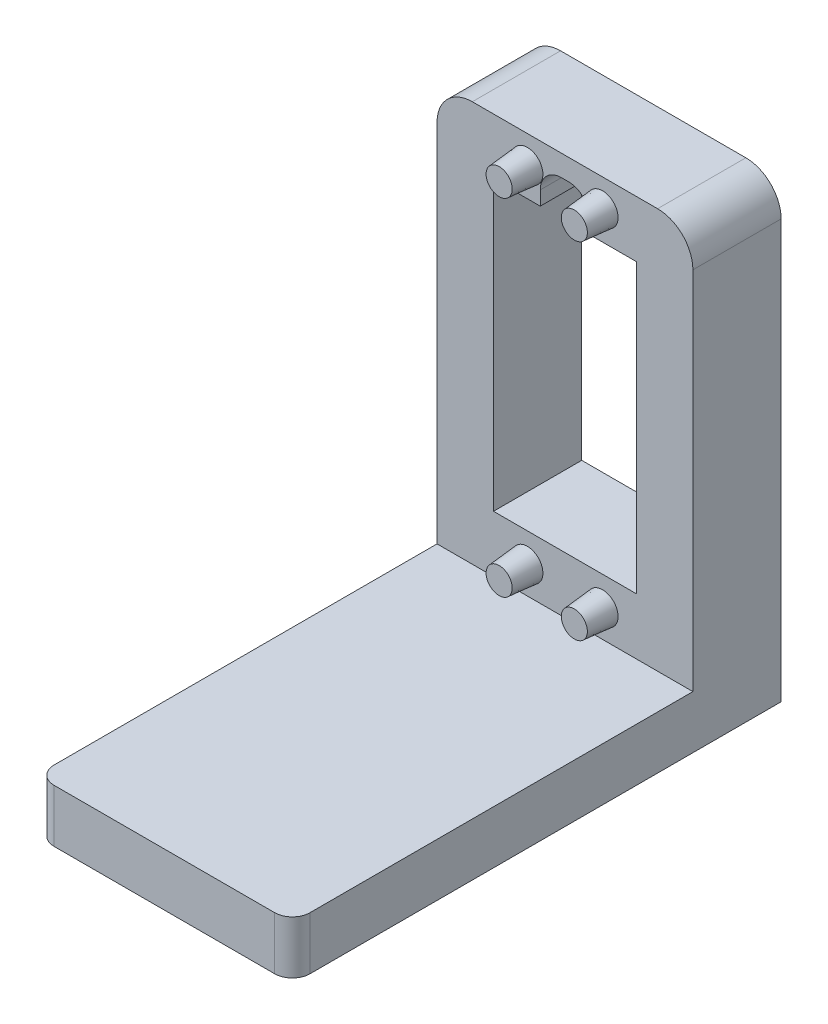
ISO-10303-21;
HEADER;
FILE_DESCRIPTION(('STEP AP214'),'2;1');
FILE_NAME('part.step','',(''),(''),'','','');
FILE_SCHEMA(('AUTOMOTIVE_DESIGN { 1 0 10303 214 1 1 1 1 }'));
ENDSEC;
DATA;
#1=APPLICATION_CONTEXT('core data for automotive mechanical design processes');
#2=APPLICATION_PROTOCOL_DEFINITION('international standard','automotive_design',2000,#1);
#3=PRODUCT_CONTEXT('',#1,'mechanical');
#4=PRODUCT('Part','Part','',(#3));
#5=PRODUCT_RELATED_PRODUCT_CATEGORY('part','',(#4));
#6=PRODUCT_DEFINITION_FORMATION('','',#4);
#7=PRODUCT_DEFINITION_CONTEXT('part definition',#1,'design');
#8=PRODUCT_DEFINITION('design','',#6,#7);
#9=PRODUCT_DEFINITION_SHAPE('','',#8);
#10=(LENGTH_UNIT() NAMED_UNIT(*) SI_UNIT(.MILLI.,.METRE.));
#11=(NAMED_UNIT(*) PLANE_ANGLE_UNIT() SI_UNIT($,.RADIAN.));
#12=(NAMED_UNIT(*) SI_UNIT($,.STERADIAN.) SOLID_ANGLE_UNIT());
#13=UNCERTAINTY_MEASURE_WITH_UNIT(LENGTH_MEASURE(1.E-05),#10,'distance_accuracy_value','');
#14=(GEOMETRIC_REPRESENTATION_CONTEXT(3) GLOBAL_UNCERTAINTY_ASSIGNED_CONTEXT((#13)) GLOBAL_UNIT_ASSIGNED_CONTEXT((#10,
#11,#12)) REPRESENTATION_CONTEXT('',''));
#15=CARTESIAN_POINT('',(0.,0.,0.));
#16=DIRECTION('',(0.,0.,1.));
#17=DIRECTION('',(1.,0.,0.));
#18=AXIS2_PLACEMENT_3D('',#15,#16,#17);
#19=CARTESIAN_POINT('',(0.,40.75,12.5));
#20=DIRECTION('',(0.,-1.,0.));
#21=DIRECTION('',(0.,0.,-1.));
#22=AXIS2_PLACEMENT_3D('',#19,#20,#21);
#23=PLANE('',#22);
#24=DIRECTION('',(0.,0.,1.));
#25=VECTOR('',#24,1.);
#26=CARTESIAN_POINT('',(6.625,40.75,0.));
#27=LINE('',#26,#25);
#28=CARTESIAN_POINT('',(6.625,40.75,0.));
#29=VERTEX_POINT('',#28);
#30=CARTESIAN_POINT('',(6.625,40.75,12.5));
#31=VERTEX_POINT('',#30);
#32=EDGE_CURVE('E177',#29,#31,#27,.T.);
#33=ORIENTED_EDGE('',*,*,#32,.T.);
#34=DIRECTION('',(-1.,0.,0.));
#35=VECTOR('',#34,1.);
#36=CARTESIAN_POINT('',(0.,40.75,12.5));
#37=LINE('',#36,#35);
#38=CARTESIAN_POINT('',(0.,40.75,12.5));
#39=VERTEX_POINT('',#38);
#40=EDGE_CURVE('E365',#31,#39,#37,.T.);
#41=ORIENTED_EDGE('',*,*,#40,.T.);
#42=DIRECTION('',(0.,0.,-1.));
#43=VECTOR('',#42,1.);
#44=CARTESIAN_POINT('',(0.,40.75,12.5));
#45=LINE('',#44,#43);
#46=CARTESIAN_POINT('',(0.,40.75,0.));
#47=VERTEX_POINT('',#46);
#48=EDGE_CURVE('E205',#39,#47,#45,.T.);
#49=ORIENTED_EDGE('',*,*,#48,.T.);
#50=DIRECTION('',(-1.,0.,0.));
#51=VECTOR('',#50,1.);
#52=CARTESIAN_POINT('',(0.,40.75,0.));
#53=LINE('',#52,#51);
#54=EDGE_CURVE('E195',#29,#47,#53,.T.);
#55=ORIENTED_EDGE('',*,*,#54,.F.);
#56=EDGE_LOOP('',(#33,#41,#49,#55));
#57=FACE_BOUND('',#56,.T.);
#58=ADVANCED_FACE('F38',(#57),#23,.T.);
#59=CARTESIAN_POINT('',(0.,0.,12.5));
#60=DIRECTION('',(0.,0.,-1.));
#61=DIRECTION('',(-1.,0.,0.));
#62=AXIS2_PLACEMENT_3D('',#59,#60,#61);
#63=PLANE('',#62);
#64=CARTESIAN_POINT('',(4.8,-4.10000000000001,12.5));
#65=DIRECTION('',(0.,0.,-1.));
#66=DIRECTION('',(-1.,0.,0.));
#67=AXIS2_PLACEMENT_3D('',#64,#65,#66);
#68=CIRCLE('',#67,2.2);
#69=CARTESIAN_POINT('',(2.6,-4.10000000000001,12.5));
#70=VERTEX_POINT('',#69);
#71=EDGE_CURVE('E270',#70,#70,#68,.F.);
#72=ORIENTED_EDGE('',*,*,#71,.F.);
#73=EDGE_LOOP('',(#72));
#74=FACE_BOUND('',#73,.T.);
#75=CARTESIAN_POINT('',(15.45,-4.10000000000001,12.5));
#76=DIRECTION('',(0.,0.,-1.));
#77=DIRECTION('',(-1.,0.,0.));
#78=AXIS2_PLACEMENT_3D('',#75,#76,#77);
#79=CIRCLE('',#78,2.2);
#80=CARTESIAN_POINT('',(13.25,-4.10000000000001,12.5));
#81=VERTEX_POINT('',#80);
#82=EDGE_CURVE('E266',#81,#81,#79,.F.);
#83=ORIENTED_EDGE('',*,*,#82,.F.);
#84=EDGE_LOOP('',(#83));
#85=FACE_BOUND('',#84,.T.);
#86=CARTESIAN_POINT('',(15.45,44.85,12.5));
#87=DIRECTION('',(0.,0.,-1.));
#88=DIRECTION('',(-1.,0.,0.));
#89=AXIS2_PLACEMENT_3D('',#86,#87,#88);
#90=CIRCLE('',#89,2.2);
#91=CARTESIAN_POINT('',(13.25,44.85,12.5));
#92=VERTEX_POINT('',#91);
#93=EDGE_CURVE('E262',#92,#92,#90,.F.);
#94=ORIENTED_EDGE('',*,*,#93,.F.);
#95=EDGE_LOOP('',(#94));
#96=FACE_BOUND('',#95,.T.);
#97=CARTESIAN_POINT('',(4.8,44.85,12.5));
#98=DIRECTION('',(0.,0.,-1.));
#99=DIRECTION('',(-1.,0.,0.));
#100=AXIS2_PLACEMENT_3D('',#97,#98,#99);
#101=CIRCLE('',#100,2.2);
#102=CARTESIAN_POINT('',(2.6,44.85,12.5));
#103=VERTEX_POINT('',#102);
#104=EDGE_CURVE('E249',#103,#103,#101,.F.);
#105=ORIENTED_EDGE('',*,*,#104,.F.);
#106=EDGE_LOOP('',(#105));
#107=FACE_BOUND('',#106,.T.);
#108=DIRECTION('',(0.,1.,0.));
#109=VECTOR('',#108,1.);
#110=CARTESIAN_POINT('',(28.25,-8.,12.5));
#111=LINE('',#110,#109);
#112=CARTESIAN_POINT('',(28.25,-8.,12.5));
#113=VERTEX_POINT('',#112);
#114=CARTESIAN_POINT('',(28.25,43.75,12.5));
#115=VERTEX_POINT('',#114);
#116=EDGE_CURVE('E241',#113,#115,#111,.T.);
#117=ORIENTED_EDGE('',*,*,#116,.T.);
#118=CARTESIAN_POINT('',(23.25,43.75,12.5));
#119=DIRECTION('',(0.,0.,-1.));
#120=DIRECTION('',(-1.,0.,0.));
#121=AXIS2_PLACEMENT_3D('',#118,#119,#120);
#122=CIRCLE('',#121,5.);
#123=CARTESIAN_POINT('',(23.25,48.75,12.5));
#124=VERTEX_POINT('',#123);
#125=EDGE_CURVE('E293',#115,#124,#122,.F.);
#126=ORIENTED_EDGE('',*,*,#125,.T.);
#127=DIRECTION('',(-1.,0.,0.));
#128=VECTOR('',#127,1.);
#129=CARTESIAN_POINT('',(-8.,48.75,12.5));
#130=LINE('',#129,#128);
#131=CARTESIAN_POINT('',(-3.,48.75,12.5));
#132=VERTEX_POINT('',#131);
#133=EDGE_CURVE('E245',#124,#132,#130,.T.);
#134=ORIENTED_EDGE('',*,*,#133,.T.);
#135=CARTESIAN_POINT('',(-3.,43.75,12.5));
#136=DIRECTION('',(0.,0.,-1.));
#137=DIRECTION('',(-1.,0.,0.));
#138=AXIS2_PLACEMENT_3D('',#135,#136,#137);
#139=CIRCLE('',#138,5.);
#140=CARTESIAN_POINT('',(-8.,43.75,12.5));
#141=VERTEX_POINT('',#140);
#142=EDGE_CURVE('E290',#132,#141,#139,.F.);
#143=ORIENTED_EDGE('',*,*,#142,.T.);
#144=DIRECTION('',(0.,-1.,0.));
#145=VECTOR('',#144,1.);
#146=CARTESIAN_POINT('',(-8.,-8.,12.5));
#147=LINE('',#146,#145);
#148=CARTESIAN_POINT('',(-8.,-8.,12.5));
#149=VERTEX_POINT('',#148);
#150=EDGE_CURVE('E233',#141,#149,#147,.T.);
#151=ORIENTED_EDGE('',*,*,#150,.T.);
#152=DIRECTION('',(1.,0.,0.));
#153=VECTOR('',#152,1.);
#154=CARTESIAN_POINT('',(-8.,-8.,12.5));
#155=LINE('',#154,#153);
#156=EDGE_CURVE('E236',#149,#113,#155,.T.);
#157=ORIENTED_EDGE('',*,*,#156,.T.);
#158=EDGE_LOOP('',(#117,#126,#134,#143,#151,#157));
#159=FACE_BOUND('',#158,.T.);
#160=ORIENTED_EDGE('',*,*,#40,.F.);
#161=DIRECTION('',(0.,-1.,0.));
#162=VECTOR('',#161,1.);
#163=CARTESIAN_POINT('',(6.625,40.75,12.5));
#164=LINE('',#163,#162);
#165=CARTESIAN_POINT('',(6.625,42.75,12.5));
#166=VERTEX_POINT('',#165);
#167=EDGE_CURVE('E183',#166,#31,#164,.T.);
#168=ORIENTED_EDGE('',*,*,#167,.F.);
#169=CARTESIAN_POINT('',(9.625,42.75,12.5));
#170=DIRECTION('',(0.,0.,1.));
#171=DIRECTION('',(1.,0.,0.));
#172=AXIS2_PLACEMENT_3D('',#169,#170,#171);
#173=CIRCLE('',#172,3.);
#174=CARTESIAN_POINT('',(9.625,45.75,12.5));
#175=VERTEX_POINT('',#174);
#176=EDGE_CURVE('E201',#175,#166,#173,.T.);
#177=ORIENTED_EDGE('',*,*,#176,.F.);
#178=DIRECTION('',(-1.,0.,0.));
#179=VECTOR('',#178,1.);
#180=CARTESIAN_POINT('',(9.625,45.75,12.5));
#181=LINE('',#180,#179);
#182=CARTESIAN_POINT('',(10.625,45.75,12.5));
#183=VERTEX_POINT('',#182);
#184=EDGE_CURVE('E416',#183,#175,#181,.T.);
#185=ORIENTED_EDGE('',*,*,#184,.F.);
#186=CARTESIAN_POINT('',(10.625,42.75,12.5));
#187=DIRECTION('',(0.,0.,1.));
#188=DIRECTION('',(-1.,0.,0.));
#189=AXIS2_PLACEMENT_3D('',#186,#187,#188);
#190=CIRCLE('',#189,3.);
#191=CARTESIAN_POINT('',(13.625,42.75,12.5));
#192=VERTEX_POINT('',#191);
#193=EDGE_CURVE('E412',#192,#183,#190,.T.);
#194=ORIENTED_EDGE('',*,*,#193,.F.);
#195=DIRECTION('',(0.,1.,0.));
#196=VECTOR('',#195,1.);
#197=CARTESIAN_POINT('',(13.625,40.75,12.5));
#198=LINE('',#197,#196);
#199=CARTESIAN_POINT('',(13.625,40.75,12.5));
#200=VERTEX_POINT('',#199);
#201=EDGE_CURVE('E407',#200,#192,#198,.T.);
#202=ORIENTED_EDGE('',*,*,#201,.F.);
#203=CARTESIAN_POINT('',(20.25,40.75,12.5));
#204=VERTEX_POINT('',#203);
#205=EDGE_CURVE('E222',#204,#200,#37,.T.);
#206=ORIENTED_EDGE('',*,*,#205,.F.);
#207=DIRECTION('',(0.,1.,0.));
#208=VECTOR('',#207,1.);
#209=CARTESIAN_POINT('',(20.25,0.,12.5));
#210=LINE('',#209,#208);
#211=CARTESIAN_POINT('',(20.25,0.,12.5));
#212=VERTEX_POINT('',#211);
#213=EDGE_CURVE('E361',#212,#204,#210,.T.);
#214=ORIENTED_EDGE('',*,*,#213,.F.);
#215=DIRECTION('',(1.,0.,0.));
#216=VECTOR('',#215,1.);
#217=CARTESIAN_POINT('',(0.,0.,12.5));
#218=LINE('',#217,#216);
#219=CARTESIAN_POINT('',(0.,0.,12.5));
#220=VERTEX_POINT('',#219);
#221=EDGE_CURVE('E358',#220,#212,#218,.T.);
#222=ORIENTED_EDGE('',*,*,#221,.F.);
#223=DIRECTION('',(0.,-1.,0.));
#224=VECTOR('',#223,1.);
#225=CARTESIAN_POINT('',(0.,0.,12.5));
#226=LINE('',#225,#224);
#227=EDGE_CURVE('E213',#39,#220,#226,.T.);
#228=ORIENTED_EDGE('',*,*,#227,.F.);
#229=EDGE_LOOP('',(#160,#168,#177,#185,#194,#202,#206,#214,#222,#228));
#230=FACE_BOUND('',#229,.T.);
#231=ADVANCED_FACE('F380',(#74,#85,#96,#107,#159,#230),#63,.F.);
#232=CARTESIAN_POINT('',(0.,0.,0.));
#233=DIRECTION('',(0.,0.,-1.));
#234=DIRECTION('',(-1.,0.,0.));
#235=AXIS2_PLACEMENT_3D('',#232,#233,#234);
#236=PLANE('',#235);
#237=DIRECTION('',(0.,-1.,0.));
#238=VECTOR('',#237,1.);
#239=CARTESIAN_POINT('',(6.625,40.75,0.));
#240=LINE('',#239,#238);
#241=CARTESIAN_POINT('',(6.625,42.75,0.));
#242=VERTEX_POINT('',#241);
#243=EDGE_CURVE('E180',#242,#29,#240,.T.);
#244=ORIENTED_EDGE('',*,*,#243,.T.);
#245=ORIENTED_EDGE('',*,*,#54,.T.);
#246=DIRECTION('',(0.,-1.,0.));
#247=VECTOR('',#246,1.);
#248=CARTESIAN_POINT('',(0.,0.,0.));
#249=LINE('',#248,#247);
#250=CARTESIAN_POINT('',(0.,0.,0.));
#251=VERTEX_POINT('',#250);
#252=EDGE_CURVE('E345',#47,#251,#249,.T.);
#253=ORIENTED_EDGE('',*,*,#252,.T.);
#254=DIRECTION('',(1.,0.,0.));
#255=VECTOR('',#254,1.);
#256=CARTESIAN_POINT('',(0.,0.,0.));
#257=LINE('',#256,#255);
#258=CARTESIAN_POINT('',(20.25,0.,0.));
#259=VERTEX_POINT('',#258);
#260=EDGE_CURVE('E215',#251,#259,#257,.T.);
#261=ORIENTED_EDGE('',*,*,#260,.T.);
#262=DIRECTION('',(0.,1.,0.));
#263=VECTOR('',#262,1.);
#264=CARTESIAN_POINT('',(20.25,0.,0.));
#265=LINE('',#264,#263);
#266=CARTESIAN_POINT('',(20.25,40.75,0.));
#267=VERTEX_POINT('',#266);
#268=EDGE_CURVE('E208',#259,#267,#265,.T.);
#269=ORIENTED_EDGE('',*,*,#268,.T.);
#270=CARTESIAN_POINT('',(13.625,40.75,0.));
#271=VERTEX_POINT('',#270);
#272=EDGE_CURVE('E207',#267,#271,#53,.T.);
#273=ORIENTED_EDGE('',*,*,#272,.T.);
#274=DIRECTION('',(0.,1.,0.));
#275=VECTOR('',#274,1.);
#276=CARTESIAN_POINT('',(13.625,40.75,0.));
#277=LINE('',#276,#275);
#278=CARTESIAN_POINT('',(13.625,42.75,0.));
#279=VERTEX_POINT('',#278);
#280=EDGE_CURVE('E200',#271,#279,#277,.T.);
#281=ORIENTED_EDGE('',*,*,#280,.T.);
#282=CARTESIAN_POINT('',(10.625,42.75,0.));
#283=DIRECTION('',(0.,0.,1.));
#284=DIRECTION('',(-1.,0.,0.));
#285=AXIS2_PLACEMENT_3D('',#282,#283,#284);
#286=CIRCLE('',#285,3.);
#287=CARTESIAN_POINT('',(10.625,45.75,0.));
#288=VERTEX_POINT('',#287);
#289=EDGE_CURVE('E392',#279,#288,#286,.T.);
#290=ORIENTED_EDGE('',*,*,#289,.T.);
#291=DIRECTION('',(-1.,0.,0.));
#292=VECTOR('',#291,1.);
#293=CARTESIAN_POINT('',(9.625,45.75,0.));
#294=LINE('',#293,#292);
#295=CARTESIAN_POINT('',(9.625,45.75,0.));
#296=VERTEX_POINT('',#295);
#297=EDGE_CURVE('E397',#288,#296,#294,.T.);
#298=ORIENTED_EDGE('',*,*,#297,.T.);
#299=CARTESIAN_POINT('',(9.625,42.75,0.));
#300=DIRECTION('',(0.,0.,1.));
#301=DIRECTION('',(1.,0.,0.));
#302=AXIS2_PLACEMENT_3D('',#299,#300,#301);
#303=CIRCLE('',#302,3.);
#304=EDGE_CURVE('E189',#296,#242,#303,.T.);
#305=ORIENTED_EDGE('',*,*,#304,.T.);
#306=EDGE_LOOP('',(#244,#245,#253,#261,#269,#273,#281,#290,#298,#305));
#307=FACE_BOUND('',#306,.T.);
#308=DIRECTION('',(-1.,0.,0.));
#309=VECTOR('',#308,1.);
#310=CARTESIAN_POINT('',(-8.,48.75,0.));
#311=LINE('',#310,#309);
#312=CARTESIAN_POINT('',(23.25,48.75,0.));
#313=VERTEX_POINT('',#312);
#314=CARTESIAN_POINT('',(-3.,48.75,0.));
#315=VERTEX_POINT('',#314);
#316=EDGE_CURVE('E237',#313,#315,#311,.T.);
#317=ORIENTED_EDGE('',*,*,#316,.F.);
#318=CARTESIAN_POINT('',(23.25,43.75,0.));
#319=DIRECTION('',(0.,0.,-1.));
#320=DIRECTION('',(-1.,0.,0.));
#321=AXIS2_PLACEMENT_3D('',#318,#319,#320);
#322=CIRCLE('',#321,5.);
#323=CARTESIAN_POINT('',(28.25,43.75,0.));
#324=VERTEX_POINT('',#323);
#325=EDGE_CURVE('E284',#313,#324,#322,.T.);
#326=ORIENTED_EDGE('',*,*,#325,.T.);
#327=DIRECTION('',(0.,1.,0.));
#328=VECTOR('',#327,1.);
#329=CARTESIAN_POINT('',(28.25,-8.,0.));
#330=LINE('',#329,#328);
#331=CARTESIAN_POINT('',(28.25,-15.5,0.));
#332=VERTEX_POINT('',#331);
#333=EDGE_CURVE('E252',#332,#324,#330,.T.);
#334=ORIENTED_EDGE('',*,*,#333,.F.);
#335=DIRECTION('',(1.,0.,0.));
#336=VECTOR('',#335,1.);
#337=CARTESIAN_POINT('',(-8.,-15.5,0.));
#338=LINE('',#337,#336);
#339=CARTESIAN_POINT('',(-8.,-15.5,0.));
#340=VERTEX_POINT('',#339);
#341=EDGE_CURVE('E332',#340,#332,#338,.T.);
#342=ORIENTED_EDGE('',*,*,#341,.F.);
#343=DIRECTION('',(0.,-1.,0.));
#344=VECTOR('',#343,1.);
#345=CARTESIAN_POINT('',(-8.,-8.,0.));
#346=LINE('',#345,#344);
#347=CARTESIAN_POINT('',(-8.,43.75,0.));
#348=VERTEX_POINT('',#347);
#349=EDGE_CURVE('E232',#348,#340,#346,.T.);
#350=ORIENTED_EDGE('',*,*,#349,.F.);
#351=CARTESIAN_POINT('',(-3.,43.75,0.));
#352=DIRECTION('',(0.,0.,-1.));
#353=DIRECTION('',(-1.,0.,0.));
#354=AXIS2_PLACEMENT_3D('',#351,#352,#353);
#355=CIRCLE('',#354,5.);
#356=EDGE_CURVE('E281',#348,#315,#355,.T.);
#357=ORIENTED_EDGE('',*,*,#356,.T.);
#358=EDGE_LOOP('',(#317,#326,#334,#342,#350,#357));
#359=FACE_BOUND('',#358,.T.);
#360=ADVANCED_FACE('F192',(#307,#359),#236,.T.);
#361=CARTESIAN_POINT('',(-8.,-8.,12.5));
#362=DIRECTION('',(1.,0.,0.));
#363=DIRECTION('',(0.,0.,-1.));
#364=AXIS2_PLACEMENT_3D('',#361,#362,#363);
#365=PLANE('',#364);
#366=DIRECTION('',(0.,0.,1.));
#367=VECTOR('',#366,1.);
#368=CARTESIAN_POINT('',(-8.,-15.5,-37.0177322374021));
#369=LINE('',#368,#367);
#370=CARTESIAN_POINT('',(-8.,-15.5,66.75));
#371=VERTEX_POINT('',#370);
#372=EDGE_CURVE('E340',#340,#371,#369,.T.);
#373=ORIENTED_EDGE('',*,*,#372,.T.);
#374=DIRECTION('',(0.,-1.,0.));
#375=VECTOR('',#374,1.);
#376=CARTESIAN_POINT('',(-8.,-8.,66.75));
#377=LINE('',#376,#375);
#378=CARTESIAN_POINT('',(-8.,-8.,66.75));
#379=VERTEX_POINT('',#378);
#380=EDGE_CURVE('E62',#371,#379,#377,.F.);
#381=ORIENTED_EDGE('',*,*,#380,.T.);
#382=DIRECTION('',(0.,0.,1.));
#383=VECTOR('',#382,1.);
#384=CARTESIAN_POINT('',(-8.,-8.,-37.0177322374021));
#385=LINE('',#384,#383);
#386=EDGE_CURVE('E323',#149,#379,#385,.T.);
#387=ORIENTED_EDGE('',*,*,#386,.F.);
#388=ORIENTED_EDGE('',*,*,#150,.F.);
#389=DIRECTION('',(0.,0.,-1.));
#390=VECTOR('',#389,1.);
#391=CARTESIAN_POINT('',(-8.,43.75,12.5));
#392=LINE('',#391,#390);
#393=EDGE_CURVE('E296',#141,#348,#392,.T.);
#394=ORIENTED_EDGE('',*,*,#393,.T.);
#395=ORIENTED_EDGE('',*,*,#349,.T.);
#396=EDGE_LOOP('',(#373,#381,#387,#388,#394,#395));
#397=FACE_BOUND('',#396,.T.);
#398=ADVANCED_FACE('F341',(#397),#365,.F.);
#399=CARTESIAN_POINT('',(28.25,-8.,12.5));
#400=DIRECTION('',(-1.,0.,0.));
#401=DIRECTION('',(0.,0.,1.));
#402=AXIS2_PLACEMENT_3D('',#399,#400,#401);
#403=PLANE('',#402);
#404=DIRECTION('',(0.,0.,1.));
#405=VECTOR('',#404,1.);
#406=CARTESIAN_POINT('',(28.25,-8.,-37.0177322374021));
#407=LINE('',#406,#405);
#408=CARTESIAN_POINT('',(28.25,-8.,66.75));
#409=VERTEX_POINT('',#408);
#410=EDGE_CURVE('E350',#113,#409,#407,.T.);
#411=ORIENTED_EDGE('',*,*,#410,.T.);
#412=DIRECTION('',(0.,1.,0.));
#413=VECTOR('',#412,1.);
#414=CARTESIAN_POINT('',(28.25,-15.5,66.75));
#415=LINE('',#414,#413);
#416=CARTESIAN_POINT('',(28.25,-15.5,66.75));
#417=VERTEX_POINT('',#416);
#418=EDGE_CURVE('E11',#409,#417,#415,.F.);
#419=ORIENTED_EDGE('',*,*,#418,.T.);
#420=DIRECTION('',(0.,0.,1.));
#421=VECTOR('',#420,1.);
#422=CARTESIAN_POINT('',(28.25,-15.5,-37.0177322374021));
#423=LINE('',#422,#421);
#424=EDGE_CURVE('E354',#332,#417,#423,.T.);
#425=ORIENTED_EDGE('',*,*,#424,.F.);
#426=ORIENTED_EDGE('',*,*,#333,.T.);
#427=DIRECTION('',(0.,0.,-1.));
#428=VECTOR('',#427,1.);
#429=CARTESIAN_POINT('',(28.25,43.75,12.5));
#430=LINE('',#429,#428);
#431=EDGE_CURVE('E287',#324,#115,#430,.F.);
#432=ORIENTED_EDGE('',*,*,#431,.T.);
#433=ORIENTED_EDGE('',*,*,#116,.F.);
#434=EDGE_LOOP('',(#411,#419,#425,#426,#432,#433));
#435=FACE_BOUND('',#434,.T.);
#436=ADVANCED_FACE('F449',(#435),#403,.F.);
#437=CARTESIAN_POINT('',(-8.,48.75,12.5));
#438=DIRECTION('',(0.,-1.,0.));
#439=DIRECTION('',(0.,0.,-1.));
#440=AXIS2_PLACEMENT_3D('',#437,#438,#439);
#441=PLANE('',#440);
#442=ORIENTED_EDGE('',*,*,#133,.F.);
#443=DIRECTION('',(0.,0.,-1.));
#444=VECTOR('',#443,1.);
#445=CARTESIAN_POINT('',(23.25,48.75,12.5));
#446=LINE('',#445,#444);
#447=EDGE_CURVE('E277',#124,#313,#446,.T.);
#448=ORIENTED_EDGE('',*,*,#447,.T.);
#449=ORIENTED_EDGE('',*,*,#316,.T.);
#450=DIRECTION('',(0.,0.,-1.));
#451=VECTOR('',#450,1.);
#452=CARTESIAN_POINT('',(-3.,48.75,12.5));
#453=LINE('',#452,#451);
#454=EDGE_CURVE('E274',#315,#132,#453,.F.);
#455=ORIENTED_EDGE('',*,*,#454,.T.);
#456=EDGE_LOOP('',(#442,#448,#449,#455));
#457=FACE_BOUND('',#456,.T.);
#458=ADVANCED_FACE('F451',(#457),#441,.F.);
#459=CARTESIAN_POINT('',(0.,0.,12.5));
#460=DIRECTION('',(1.,0.,0.));
#461=DIRECTION('',(0.,0.,-1.));
#462=AXIS2_PLACEMENT_3D('',#459,#460,#461);
#463=PLANE('',#462);
#464=ORIENTED_EDGE('',*,*,#252,.F.);
#465=ORIENTED_EDGE('',*,*,#48,.F.);
#466=ORIENTED_EDGE('',*,*,#227,.T.);
#467=DIRECTION('',(0.,0.,-1.));
#468=VECTOR('',#467,1.);
#469=CARTESIAN_POINT('',(0.,0.,12.5));
#470=LINE('',#469,#468);
#471=EDGE_CURVE('E228',#220,#251,#470,.T.);
#472=ORIENTED_EDGE('',*,*,#471,.T.);
#473=EDGE_LOOP('',(#464,#465,#466,#472));
#474=FACE_BOUND('',#473,.T.);
#475=ADVANCED_FACE('F377',(#474),#463,.T.);
#476=CARTESIAN_POINT('',(0.,0.,12.5));
#477=DIRECTION('',(0.,1.,0.));
#478=DIRECTION('',(0.,0.,1.));
#479=AXIS2_PLACEMENT_3D('',#476,#477,#478);
#480=PLANE('',#479);
#481=ORIENTED_EDGE('',*,*,#260,.F.);
#482=ORIENTED_EDGE('',*,*,#471,.F.);
#483=ORIENTED_EDGE('',*,*,#221,.T.);
#484=DIRECTION('',(0.,0.,-1.));
#485=VECTOR('',#484,1.);
#486=CARTESIAN_POINT('',(20.25,0.,12.5));
#487=LINE('',#486,#485);
#488=EDGE_CURVE('E225',#212,#259,#487,.T.);
#489=ORIENTED_EDGE('',*,*,#488,.T.);
#490=EDGE_LOOP('',(#481,#482,#483,#489));
#491=FACE_BOUND('',#490,.T.);
#492=ADVANCED_FACE('F373',(#491),#480,.T.);
#493=CARTESIAN_POINT('',(20.25,0.,12.5));
#494=DIRECTION('',(-1.,0.,0.));
#495=DIRECTION('',(0.,0.,1.));
#496=AXIS2_PLACEMENT_3D('',#493,#494,#495);
#497=PLANE('',#496);
#498=ORIENTED_EDGE('',*,*,#268,.F.);
#499=ORIENTED_EDGE('',*,*,#488,.F.);
#500=ORIENTED_EDGE('',*,*,#213,.T.);
#501=DIRECTION('',(0.,0.,-1.));
#502=VECTOR('',#501,1.);
#503=CARTESIAN_POINT('',(20.25,40.75,12.5));
#504=LINE('',#503,#502);
#505=EDGE_CURVE('E221',#204,#267,#504,.T.);
#506=ORIENTED_EDGE('',*,*,#505,.T.);
#507=EDGE_LOOP('',(#498,#499,#500,#506));
#508=FACE_BOUND('',#507,.T.);
#509=ADVANCED_FACE('F384',(#508),#497,.T.);
#510=DIRECTION('',(0.,0.,1.));
#511=VECTOR('',#510,1.);
#512=CARTESIAN_POINT('',(13.625,40.75,0.));
#513=LINE('',#512,#511);
#514=EDGE_CURVE('E188',#271,#200,#513,.T.);
#515=ORIENTED_EDGE('',*,*,#514,.F.);
#516=ORIENTED_EDGE('',*,*,#272,.F.);
#517=ORIENTED_EDGE('',*,*,#505,.F.);
#518=ORIENTED_EDGE('',*,*,#205,.T.);
#519=EDGE_LOOP('',(#515,#516,#517,#518));
#520=FACE_BOUND('',#519,.T.);
#521=ADVANCED_FACE('F388',(#520),#23,.T.);
#522=CARTESIAN_POINT('',(-8.,-8.,-37.0177322374021));
#523=DIRECTION('',(0.,1.,0.));
#524=DIRECTION('',(0.,0.,1.));
#525=AXIS2_PLACEMENT_3D('',#522,#523,#524);
#526=PLANE('',#525);
#527=ORIENTED_EDGE('',*,*,#386,.T.);
#528=CARTESIAN_POINT('',(-5.5,-8.,66.75));
#529=DIRECTION('',(0.,1.,0.));
#530=DIRECTION('',(0.,0.,1.));
#531=AXIS2_PLACEMENT_3D('',#528,#529,#530);
#532=CIRCLE('',#531,2.5);
#533=CARTESIAN_POINT('',(-5.5,-8.,69.25));
#534=VERTEX_POINT('',#533);
#535=EDGE_CURVE('E47',#379,#534,#532,.T.);
#536=ORIENTED_EDGE('',*,*,#535,.T.);
#537=DIRECTION('',(-1.,0.,0.));
#538=VECTOR('',#537,1.);
#539=CARTESIAN_POINT('',(-8.,-8.,69.25));
#540=LINE('',#539,#538);
#541=CARTESIAN_POINT('',(25.75,-8.,69.25));
#542=VERTEX_POINT('',#541);
#543=EDGE_CURVE('E321',#542,#534,#540,.T.);
#544=ORIENTED_EDGE('',*,*,#543,.F.);
#545=CARTESIAN_POINT('',(25.75,-8.,66.75));
#546=DIRECTION('',(0.,1.,0.));
#547=DIRECTION('',(0.,0.,1.));
#548=AXIS2_PLACEMENT_3D('',#545,#546,#547);
#549=CIRCLE('',#548,2.5);
#550=EDGE_CURVE('E54',#542,#409,#549,.T.);
#551=ORIENTED_EDGE('',*,*,#550,.T.);
#552=ORIENTED_EDGE('',*,*,#410,.F.);
#553=ORIENTED_EDGE('',*,*,#156,.F.);
#554=EDGE_LOOP('',(#527,#536,#544,#551,#552,#553));
#555=FACE_BOUND('',#554,.T.);
#556=ADVANCED_FACE('F320',(#555),#526,.T.);
#557=CARTESIAN_POINT('',(-8.,-15.5,-37.0177322374021));
#558=DIRECTION('',(0.,-1.,0.));
#559=DIRECTION('',(0.,0.,-1.));
#560=AXIS2_PLACEMENT_3D('',#557,#558,#559);
#561=PLANE('',#560);
#562=DIRECTION('',(1.,0.,0.));
#563=VECTOR('',#562,1.);
#564=CARTESIAN_POINT('',(-8.,-15.5,69.25));
#565=LINE('',#564,#563);
#566=CARTESIAN_POINT('',(-5.5,-15.5,69.25));
#567=VERTEX_POINT('',#566);
#568=CARTESIAN_POINT('',(25.75,-15.5,69.25));
#569=VERTEX_POINT('',#568);
#570=EDGE_CURVE('E333',#567,#569,#565,.T.);
#571=ORIENTED_EDGE('',*,*,#570,.F.);
#572=CARTESIAN_POINT('',(-5.5,-15.5,66.75));
#573=DIRECTION('',(0.,-1.,0.));
#574=DIRECTION('',(0.,0.,-1.));
#575=AXIS2_PLACEMENT_3D('',#572,#573,#574);
#576=CIRCLE('',#575,2.5);
#577=EDGE_CURVE('E311',#567,#371,#576,.T.);
#578=ORIENTED_EDGE('',*,*,#577,.T.);
#579=ORIENTED_EDGE('',*,*,#372,.F.);
#580=ORIENTED_EDGE('',*,*,#341,.T.);
#581=ORIENTED_EDGE('',*,*,#424,.T.);
#582=CARTESIAN_POINT('',(25.75,-15.5,66.75));
#583=DIRECTION('',(0.,-1.,0.));
#584=DIRECTION('',(0.,0.,-1.));
#585=AXIS2_PLACEMENT_3D('',#582,#583,#584);
#586=CIRCLE('',#585,2.5);
#587=EDGE_CURVE('E308',#417,#569,#586,.T.);
#588=ORIENTED_EDGE('',*,*,#587,.T.);
#589=EDGE_LOOP('',(#571,#578,#579,#580,#581,#588));
#590=FACE_BOUND('',#589,.T.);
#591=ADVANCED_FACE('F338',(#590),#561,.T.);
#592=CARTESIAN_POINT('',(0.,0.,69.25));
#593=DIRECTION('',(0.,0.,1.));
#594=DIRECTION('',(1.,0.,0.));
#595=AXIS2_PLACEMENT_3D('',#592,#593,#594);
#596=PLANE('',#595);
#597=ORIENTED_EDGE('',*,*,#543,.T.);
#598=DIRECTION('',(0.,-1.,0.));
#599=VECTOR('',#598,1.);
#600=CARTESIAN_POINT('',(-5.5,-15.5,69.25));
#601=LINE('',#600,#599);
#602=EDGE_CURVE('E304',#534,#567,#601,.T.);
#603=ORIENTED_EDGE('',*,*,#602,.T.);
#604=ORIENTED_EDGE('',*,*,#570,.T.);
#605=DIRECTION('',(0.,1.,0.));
#606=VECTOR('',#605,1.);
#607=CARTESIAN_POINT('',(25.75,-8.,69.25));
#608=LINE('',#607,#606);
#609=EDGE_CURVE('E300',#569,#542,#608,.T.);
#610=ORIENTED_EDGE('',*,*,#609,.T.);
#611=EDGE_LOOP('',(#597,#603,#604,#610));
#612=FACE_BOUND('',#611,.T.);
#613=ADVANCED_FACE('F327',(#612),#596,.T.);
#614=CARTESIAN_POINT('',(6.625,40.75,0.));
#615=DIRECTION('',(-1.,0.,0.));
#616=DIRECTION('',(0.,0.,1.));
#617=AXIS2_PLACEMENT_3D('',#614,#615,#616);
#618=PLANE('',#617);
#619=ORIENTED_EDGE('',*,*,#167,.T.);
#620=ORIENTED_EDGE('',*,*,#32,.F.);
#621=ORIENTED_EDGE('',*,*,#243,.F.);
#622=DIRECTION('',(0.,0.,1.));
#623=VECTOR('',#622,1.);
#624=CARTESIAN_POINT('',(6.625,42.75,0.));
#625=LINE('',#624,#623);
#626=EDGE_CURVE('E423',#242,#166,#625,.T.);
#627=ORIENTED_EDGE('',*,*,#626,.T.);
#628=EDGE_LOOP('',(#619,#620,#621,#627));
#629=FACE_BOUND('',#628,.T.);
#630=ADVANCED_FACE('F179',(#629),#618,.F.);
#631=CARTESIAN_POINT('',(9.625,42.75,0.));
#632=DIRECTION('',(0.,0.,1.));
#633=DIRECTION('',(1.,0.,0.));
#634=AXIS2_PLACEMENT_3D('',#631,#632,#633);
#635=CYLINDRICAL_SURFACE('',#634,3.);
#636=ORIENTED_EDGE('',*,*,#176,.T.);
#637=ORIENTED_EDGE('',*,*,#626,.F.);
#638=ORIENTED_EDGE('',*,*,#304,.F.);
#639=DIRECTION('',(0.,0.,1.));
#640=VECTOR('',#639,1.);
#641=CARTESIAN_POINT('',(9.625,45.75,0.));
#642=LINE('',#641,#640);
#643=EDGE_CURVE('E426',#296,#175,#642,.T.);
#644=ORIENTED_EDGE('',*,*,#643,.T.);
#645=EDGE_LOOP('',(#636,#637,#638,#644));
#646=FACE_BOUND('',#645,.T.);
#647=ADVANCED_FACE('F537',(#646),#635,.F.);
#648=CARTESIAN_POINT('',(9.625,45.75,0.));
#649=DIRECTION('',(0.,1.,0.));
#650=DIRECTION('',(0.,0.,1.));
#651=AXIS2_PLACEMENT_3D('',#648,#649,#650);
#652=PLANE('',#651);
#653=ORIENTED_EDGE('',*,*,#184,.T.);
#654=ORIENTED_EDGE('',*,*,#643,.F.);
#655=ORIENTED_EDGE('',*,*,#297,.F.);
#656=DIRECTION('',(0.,0.,1.));
#657=VECTOR('',#656,1.);
#658=CARTESIAN_POINT('',(10.625,45.75,0.));
#659=LINE('',#658,#657);
#660=EDGE_CURVE('E429',#288,#183,#659,.T.);
#661=ORIENTED_EDGE('',*,*,#660,.T.);
#662=EDGE_LOOP('',(#653,#654,#655,#661));
#663=FACE_BOUND('',#662,.T.);
#664=ADVANCED_FACE('F547',(#663),#652,.F.);
#665=CARTESIAN_POINT('',(10.625,42.75,0.));
#666=DIRECTION('',(0.,0.,1.));
#667=DIRECTION('',(1.,0.,0.));
#668=AXIS2_PLACEMENT_3D('',#665,#666,#667);
#669=CYLINDRICAL_SURFACE('',#668,3.);
#670=ORIENTED_EDGE('',*,*,#193,.T.);
#671=ORIENTED_EDGE('',*,*,#660,.F.);
#672=ORIENTED_EDGE('',*,*,#289,.F.);
#673=DIRECTION('',(0.,0.,1.));
#674=VECTOR('',#673,1.);
#675=CARTESIAN_POINT('',(13.625,42.75,0.));
#676=LINE('',#675,#674);
#677=EDGE_CURVE('E432',#279,#192,#676,.T.);
#678=ORIENTED_EDGE('',*,*,#677,.T.);
#679=EDGE_LOOP('',(#670,#671,#672,#678));
#680=FACE_BOUND('',#679,.T.);
#681=ADVANCED_FACE('F557',(#680),#669,.F.);
#682=CARTESIAN_POINT('',(13.625,40.75,0.));
#683=DIRECTION('',(1.,0.,0.));
#684=DIRECTION('',(0.,0.,-1.));
#685=AXIS2_PLACEMENT_3D('',#682,#683,#684);
#686=PLANE('',#685);
#687=ORIENTED_EDGE('',*,*,#201,.T.);
#688=ORIENTED_EDGE('',*,*,#677,.F.);
#689=ORIENTED_EDGE('',*,*,#280,.F.);
#690=ORIENTED_EDGE('',*,*,#514,.T.);
#691=EDGE_LOOP('',(#687,#688,#689,#690));
#692=FACE_BOUND('',#691,.T.);
#693=ADVANCED_FACE('F567',(#692),#686,.F.);
#694=CARTESIAN_POINT('',(4.8,44.85,12.5));
#695=DIRECTION('',(0.,0.,-1.));
#696=DIRECTION('',(1.,0.,0.));
#697=AXIS2_PLACEMENT_3D('',#694,#695,#696);
#698=CONICAL_SURFACE('',#697,2.2,0.0872664625997165);
#699=CARTESIAN_POINT('',(4.8,44.85,16.5));
#700=DIRECTION('',(0.,0.,1.));
#701=DIRECTION('',(1.,0.,0.));
#702=AXIS2_PLACEMENT_3D('',#699,#700,#701);
#703=CIRCLE('',#702,1.8500453458963);
#704=CARTESIAN_POINT('',(6.6500453458963,44.85,16.5));
#705=VERTEX_POINT('',#704);
#706=EDGE_CURVE('E408',#705,#705,#703,.T.);
#707=ORIENTED_EDGE('',*,*,#706,.F.);
#708=EDGE_LOOP('',(#707));
#709=FACE_BOUND('',#708,.T.);
#710=ORIENTED_EDGE('',*,*,#104,.T.);
#711=EDGE_LOOP('',(#710));
#712=FACE_BOUND('',#711,.T.);
#713=ADVANCED_FACE('F577',(#709,#712),#698,.T.);
#714=CARTESIAN_POINT('',(4.8,44.85,16.5));
#715=DIRECTION('',(0.,0.,1.));
#716=DIRECTION('',(1.,0.,0.));
#717=AXIS2_PLACEMENT_3D('',#714,#715,#716);
#718=PLANE('',#717);
#719=ORIENTED_EDGE('',*,*,#706,.T.);
#720=EDGE_LOOP('',(#719));
#721=FACE_BOUND('',#720,.T.);
#722=ADVANCED_FACE('F586',(#721),#718,.T.);
#723=CARTESIAN_POINT('',(15.45,44.85,12.5));
#724=DIRECTION('',(0.,0.,-1.));
#725=DIRECTION('',(-1.,0.,0.));
#726=AXIS2_PLACEMENT_3D('',#723,#724,#725);
#727=CONICAL_SURFACE('',#726,2.2,0.0872664625997165);
#728=CARTESIAN_POINT('',(15.45,44.85,16.5));
#729=DIRECTION('',(0.,0.,-1.));
#730=DIRECTION('',(-1.,0.,0.));
#731=AXIS2_PLACEMENT_3D('',#728,#729,#730);
#732=CIRCLE('',#731,1.8500453458963);
#733=CARTESIAN_POINT('',(13.5999546541037,44.85,16.5));
#734=VERTEX_POINT('',#733);
#735=EDGE_CURVE('E744',#734,#734,#732,.F.);
#736=ORIENTED_EDGE('',*,*,#735,.F.);
#737=EDGE_LOOP('',(#736));
#738=FACE_BOUND('',#737,.T.);
#739=ORIENTED_EDGE('',*,*,#93,.T.);
#740=EDGE_LOOP('',(#739));
#741=FACE_BOUND('',#740,.T.);
#742=ADVANCED_FACE('F596',(#738,#741),#727,.T.);
#743=CARTESIAN_POINT('',(15.45,44.85,16.5));
#744=DIRECTION('',(0.,0.,-1.));
#745=DIRECTION('',(-1.,0.,0.));
#746=AXIS2_PLACEMENT_3D('',#743,#744,#745);
#747=PLANE('',#746);
#748=ORIENTED_EDGE('',*,*,#735,.T.);
#749=EDGE_LOOP('',(#748));
#750=FACE_BOUND('',#749,.T.);
#751=ADVANCED_FACE('F606',(#750),#747,.F.);
#752=CARTESIAN_POINT('',(15.45,-4.10000000000001,12.5));
#753=DIRECTION('',(0.,0.,-1.));
#754=DIRECTION('',(1.,0.,0.));
#755=AXIS2_PLACEMENT_3D('',#752,#753,#754);
#756=CONICAL_SURFACE('',#755,2.2,0.0872664625997165);
#757=CARTESIAN_POINT('',(15.45,-4.10000000000001,16.5));
#758=DIRECTION('',(0.,0.,1.));
#759=DIRECTION('',(1.,0.,0.));
#760=AXIS2_PLACEMENT_3D('',#757,#758,#759);
#761=CIRCLE('',#760,1.8500453458963);
#762=CARTESIAN_POINT('',(17.3000453458963,-4.10000000000001,16.5));
#763=VERTEX_POINT('',#762);
#764=EDGE_CURVE('E740',#763,#763,#761,.T.);
#765=ORIENTED_EDGE('',*,*,#764,.F.);
#766=EDGE_LOOP('',(#765));
#767=FACE_BOUND('',#766,.T.);
#768=ORIENTED_EDGE('',*,*,#82,.T.);
#769=EDGE_LOOP('',(#768));
#770=FACE_BOUND('',#769,.T.);
#771=ADVANCED_FACE('F616',(#767,#770),#756,.T.);
#772=CARTESIAN_POINT('',(15.45,-4.10000000000001,16.5));
#773=DIRECTION('',(0.,0.,1.));
#774=DIRECTION('',(1.,0.,0.));
#775=AXIS2_PLACEMENT_3D('',#772,#773,#774);
#776=PLANE('',#775);
#777=ORIENTED_EDGE('',*,*,#764,.T.);
#778=EDGE_LOOP('',(#777));
#779=FACE_BOUND('',#778,.T.);
#780=ADVANCED_FACE('F626',(#779),#776,.T.);
#781=CARTESIAN_POINT('',(4.8,-4.10000000000001,12.5));
#782=DIRECTION('',(0.,0.,-1.));
#783=DIRECTION('',(-1.,0.,0.));
#784=AXIS2_PLACEMENT_3D('',#781,#782,#783);
#785=CONICAL_SURFACE('',#784,2.2,0.0872664625997165);
#786=CARTESIAN_POINT('',(4.8,-4.10000000000001,16.5));
#787=DIRECTION('',(0.,0.,-1.));
#788=DIRECTION('',(-1.,0.,0.));
#789=AXIS2_PLACEMENT_3D('',#786,#787,#788);
#790=CIRCLE('',#789,1.8500453458963);
#791=CARTESIAN_POINT('',(2.9499546541037,-4.10000000000001,16.5));
#792=VERTEX_POINT('',#791);
#793=EDGE_CURVE('E738',#792,#792,#790,.F.);
#794=ORIENTED_EDGE('',*,*,#793,.F.);
#795=EDGE_LOOP('',(#794));
#796=FACE_BOUND('',#795,.T.);
#797=ORIENTED_EDGE('',*,*,#71,.T.);
#798=EDGE_LOOP('',(#797));
#799=FACE_BOUND('',#798,.T.);
#800=ADVANCED_FACE('F636',(#796,#799),#785,.T.);
#801=CARTESIAN_POINT('',(4.8,-4.10000000000001,16.5));
#802=DIRECTION('',(0.,0.,-1.));
#803=DIRECTION('',(-1.,0.,0.));
#804=AXIS2_PLACEMENT_3D('',#801,#802,#803);
#805=PLANE('',#804);
#806=ORIENTED_EDGE('',*,*,#793,.T.);
#807=EDGE_LOOP('',(#806));
#808=FACE_BOUND('',#807,.T.);
#809=ADVANCED_FACE('F646',(#808),#805,.F.);
#810=CARTESIAN_POINT('',(23.25,43.75,12.5));
#811=DIRECTION('',(0.,0.,-1.));
#812=DIRECTION('',(-1.,0.,0.));
#813=AXIS2_PLACEMENT_3D('',#810,#811,#812);
#814=CYLINDRICAL_SURFACE('',#813,5.);
#815=ORIENTED_EDGE('',*,*,#125,.F.);
#816=ORIENTED_EDGE('',*,*,#431,.F.);
#817=ORIENTED_EDGE('',*,*,#325,.F.);
#818=ORIENTED_EDGE('',*,*,#447,.F.);
#819=EDGE_LOOP('',(#815,#816,#817,#818));
#820=FACE_BOUND('',#819,.T.);
#821=ADVANCED_FACE('F655',(#820),#814,.T.);
#822=CARTESIAN_POINT('',(-3.,43.75,12.5));
#823=DIRECTION('',(0.,0.,-1.));
#824=DIRECTION('',(-1.,0.,0.));
#825=AXIS2_PLACEMENT_3D('',#822,#823,#824);
#826=CYLINDRICAL_SURFACE('',#825,5.);
#827=ORIENTED_EDGE('',*,*,#142,.F.);
#828=ORIENTED_EDGE('',*,*,#454,.F.);
#829=ORIENTED_EDGE('',*,*,#356,.F.);
#830=ORIENTED_EDGE('',*,*,#393,.F.);
#831=EDGE_LOOP('',(#827,#828,#829,#830));
#832=FACE_BOUND('',#831,.T.);
#833=ADVANCED_FACE('F682',(#832),#826,.T.);
#834=CARTESIAN_POINT('',(-5.5,0.,66.75));
#835=DIRECTION('',(0.,1.,0.));
#836=DIRECTION('',(0.,0.,1.));
#837=AXIS2_PLACEMENT_3D('',#834,#835,#836);
#838=CYLINDRICAL_SURFACE('',#837,2.5);
#839=ORIENTED_EDGE('',*,*,#535,.F.);
#840=ORIENTED_EDGE('',*,*,#380,.F.);
#841=ORIENTED_EDGE('',*,*,#577,.F.);
#842=ORIENTED_EDGE('',*,*,#602,.F.);
#843=EDGE_LOOP('',(#839,#840,#841,#842));
#844=FACE_BOUND('',#843,.T.);
#845=ADVANCED_FACE('F335',(#844),#838,.T.);
#846=CARTESIAN_POINT('',(25.75,0.,66.75));
#847=DIRECTION('',(0.,-1.,0.));
#848=DIRECTION('',(0.,0.,-1.));
#849=AXIS2_PLACEMENT_3D('',#846,#847,#848);
#850=CYLINDRICAL_SURFACE('',#849,2.5);
#851=ORIENTED_EDGE('',*,*,#587,.F.);
#852=ORIENTED_EDGE('',*,*,#418,.F.);
#853=ORIENTED_EDGE('',*,*,#550,.F.);
#854=ORIENTED_EDGE('',*,*,#609,.F.);
#855=EDGE_LOOP('',(#851,#852,#853,#854));
#856=FACE_BOUND('',#855,.T.);
#857=ADVANCED_FACE('F40',(#856),#850,.T.);
#858=CLOSED_SHELL('',(#58,#231,#360,#398,#436,#458,#475,#492,#509,#521,#556,#591,#613,#630,#647,
#664,#681,#693,#713,#722,#742,#751,#771,#780,#800,#809,#821,#833,#845,#857));
#859=MANIFOLD_SOLID_BREP('B2',#858);
#860=ADVANCED_BREP_SHAPE_REPRESENTATION('',(#18,#859),#14);
#861=SHAPE_DEFINITION_REPRESENTATION(#9,#860);
ENDSEC;
END-ISO-10303-21;
